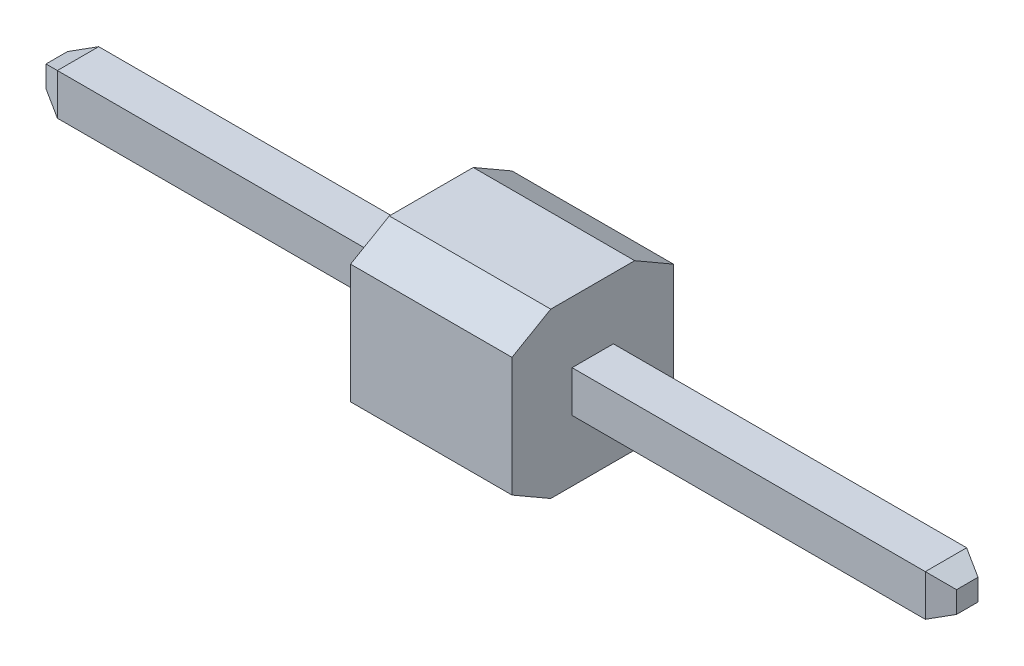
ISO-10303-21;
HEADER;
FILE_DESCRIPTION(('STEP AP214'),'2;1');
FILE_NAME('part.step','',(''),(''),'','','');
FILE_SCHEMA(('AUTOMOTIVE_DESIGN { 1 0 10303 214 1 1 1 1 }'));
ENDSEC;
DATA;
#1=APPLICATION_CONTEXT('core data for automotive mechanical design processes');
#2=APPLICATION_PROTOCOL_DEFINITION('international standard','automotive_design',2000,#1);
#3=PRODUCT_CONTEXT('',#1,'mechanical');
#4=PRODUCT('Part','Part','',(#3));
#5=PRODUCT_RELATED_PRODUCT_CATEGORY('part','',(#4));
#6=PRODUCT_DEFINITION_FORMATION('','',#4);
#7=PRODUCT_DEFINITION_CONTEXT('part definition',#1,'design');
#8=PRODUCT_DEFINITION('design','',#6,#7);
#9=PRODUCT_DEFINITION_SHAPE('','',#8);
#10=(LENGTH_UNIT() NAMED_UNIT(*) SI_UNIT(.MILLI.,.METRE.));
#11=(NAMED_UNIT(*) PLANE_ANGLE_UNIT() SI_UNIT($,.RADIAN.));
#12=(NAMED_UNIT(*) SI_UNIT($,.STERADIAN.) SOLID_ANGLE_UNIT());
#13=UNCERTAINTY_MEASURE_WITH_UNIT(LENGTH_MEASURE(1.E-05),#10,'distance_accuracy_value','');
#14=(GEOMETRIC_REPRESENTATION_CONTEXT(3) GLOBAL_UNCERTAINTY_ASSIGNED_CONTEXT((#13)) GLOBAL_UNIT_ASSIGNED_CONTEXT((#10,
#11,#12)) REPRESENTATION_CONTEXT('',''));
#15=CARTESIAN_POINT('',(0.,0.,0.));
#16=DIRECTION('',(0.,0.,1.));
#17=DIRECTION('',(1.,0.,0.));
#18=AXIS2_PLACEMENT_3D('',#15,#16,#17);
#19=CARTESIAN_POINT('',(5.42104970590608,9.84287173708609,0.629998634255617));
#20=DIRECTION('',(1.,4.37113882867379E-08,-4.37113882867379E-08));
#21=DIRECTION('',(-4.37113882867379E-08,1.,0.));
#22=AXIS2_PLACEMENT_3D('',#19,#20,#21);
#23=PLANE('',#22);
#24=DIRECTION('',(1.59994790123753E-08,0.500000000000192,0.866025403784328));
#25=VECTOR('',#24,1.);
#26=CARTESIAN_POINT('',(5.42104958292016,11.0864615755721,-0.940001365744382));
#27=LINE('',#26,#25);
#28=CARTESIAN_POINT('',(5.42104958292016,11.0864615755721,-0.940001365744382));
#29=VERTEX_POINT('',#28);
#30=CARTESIAN_POINT('',(5.42104959400492,11.4328717370861,-0.340001365744383));
#31=VERTEX_POINT('',#30);
#32=EDGE_CURVE('E11',#29,#31,#27,.T.);
#33=ORIENTED_EDGE('',*,*,#32,.T.);
#34=DIRECTION('',(4.37113886966664E-08,0.,0.999999999999999));
#35=VECTOR('',#34,1.);
#36=CARTESIAN_POINT('',(5.42104959400492,11.4328717370861,-0.340001365744383));
#37=LINE('',#36,#35);
#38=CARTESIAN_POINT('',(5.42104965082973,11.4328717370861,0.959998634255618));
#39=VERTEX_POINT('',#38);
#40=EDGE_CURVE('E304',#31,#39,#37,.T.);
#41=ORIENTED_EDGE('',*,*,#40,.T.);
#42=DIRECTION('',(5.97108656004285E-08,-0.500000000000188,0.866025403784328));
#43=VECTOR('',#42,1.);
#44=CARTESIAN_POINT('',(5.42104965082973,11.4328717370861,0.959998634255618));
#45=LINE('',#44,#43);
#46=CARTESIAN_POINT('',(5.42104969219863,11.0864615755721,1.55999863425562));
#47=VERTEX_POINT('',#46);
#48=EDGE_CURVE('E296',#39,#47,#45,.T.);
#49=ORIENTED_EDGE('',*,*,#48,.T.);
#50=DIRECTION('',(4.37113884815072E-08,-0.999999999999999,0.));
#51=VECTOR('',#50,1.);
#52=CARTESIAN_POINT('',(5.42104969219863,11.0864615755721,1.55999863425562));
#53=LINE('',#52,#51);
#54=CARTESIAN_POINT('',(5.42104977294142,9.23928189860009,1.55999863425562));
#55=VERTEX_POINT('',#54);
#56=EDGE_CURVE('E281',#47,#55,#53,.T.);
#57=ORIENTED_EDGE('',*,*,#56,.T.);
#58=DIRECTION('',(1.59994777304001E-08,0.500000000000192,0.866025403784328));
#59=VECTOR('',#58,1.);
#60=CARTESIAN_POINT('',(5.42104976185665,8.89287173708609,0.959998634255618));
#61=LINE('',#60,#59);
#62=CARTESIAN_POINT('',(5.42104976185665,8.89287173708609,0.959998634255618));
#63=VERTEX_POINT('',#62);
#64=EDGE_CURVE('E265',#63,#55,#61,.T.);
#65=ORIENTED_EDGE('',*,*,#64,.F.);
#66=DIRECTION('',(4.37113886966664E-08,0.,0.999999999999999));
#67=VECTOR('',#66,1.);
#68=CARTESIAN_POINT('',(5.42104970503185,8.89287173708609,-0.340001365744383));
#69=LINE('',#68,#67);
#70=CARTESIAN_POINT('',(5.42104970503185,8.89287173708609,-0.340001365744383));
#71=VERTEX_POINT('',#70);
#72=EDGE_CURVE('E248',#71,#63,#69,.T.);
#73=ORIENTED_EDGE('',*,*,#72,.F.);
#74=DIRECTION('',(5.97108668824036E-08,-0.500000000000188,0.866025403784328));
#75=VECTOR('',#74,1.);
#76=CARTESIAN_POINT('',(5.42104966366295,9.23928189860009,-0.940001365744382));
#77=LINE('',#76,#75);
#78=CARTESIAN_POINT('',(5.42104966366295,9.23928189860009,-0.940001365744382));
#79=VERTEX_POINT('',#78);
#80=EDGE_CURVE('E242',#79,#71,#77,.T.);
#81=ORIENTED_EDGE('',*,*,#80,.F.);
#82=DIRECTION('',(4.37113884815072E-08,-0.999999999999999,0.));
#83=VECTOR('',#82,1.);
#84=CARTESIAN_POINT('',(5.42104958292016,11.0864615755721,-0.940001365744382));
#85=LINE('',#84,#83);
#86=EDGE_CURVE('E236',#29,#79,#85,.T.);
#87=ORIENTED_EDGE('',*,*,#86,.F.);
#88=EDGE_LOOP('',(#33,#41,#49,#57,#65,#73,#81,#87));
#89=FACE_BOUND('',#88,.T.);
#90=DIRECTION('',(-4.37113886753159E-08,0.,-0.999999999999999));
#91=VECTOR('',#90,1.);
#92=CARTESIAN_POINT('',(5.42104967793079,10.4828717370861,0.629998634255617));
#93=LINE('',#92,#91);
#94=CARTESIAN_POINT('',(5.42104967793079,10.4828717370861,0.629998634255617));
#95=VERTEX_POINT('',#94);
#96=CARTESIAN_POINT('',(5.4210496499555,10.4828717370861,-0.0100013657443826));
#97=VERTEX_POINT('',#96);
#98=EDGE_CURVE('E302',#95,#97,#93,.T.);
#99=ORIENTED_EDGE('',*,*,#98,.T.);
#100=DIRECTION('',(-4.3711388675316E-08,0.999999999999999,0.));
#101=VECTOR('',#100,1.);
#102=CARTESIAN_POINT('',(5.42104967793079,9.84287173708609,-0.0100013657443826));
#103=LINE('',#102,#101);
#104=CARTESIAN_POINT('',(5.42104967793079,9.84287173708609,-0.0100013657443826));
#105=VERTEX_POINT('',#104);
#106=EDGE_CURVE('E293',#105,#97,#103,.T.);
#107=ORIENTED_EDGE('',*,*,#106,.F.);
#108=DIRECTION('',(-4.37113886753159E-08,0.,-0.999999999999999));
#109=VECTOR('',#108,1.);
#110=CARTESIAN_POINT('',(5.42104970590608,9.84287173708609,0.629998634255617));
#111=LINE('',#110,#109);
#112=CARTESIAN_POINT('',(5.42104970590608,9.84287173708609,0.629998634255617));
#113=VERTEX_POINT('',#112);
#114=EDGE_CURVE('E278',#113,#105,#111,.T.);
#115=ORIENTED_EDGE('',*,*,#114,.F.);
#116=DIRECTION('',(-4.3711388675316E-08,0.999999999999999,0.));
#117=VECTOR('',#116,1.);
#118=CARTESIAN_POINT('',(5.42104970590608,9.84287173708609,0.629998634255617));
#119=LINE('',#118,#117);
#120=EDGE_CURVE('E263',#113,#95,#119,.T.);
#121=ORIENTED_EDGE('',*,*,#120,.T.);
#122=EDGE_LOOP('',(#99,#107,#115,#121));
#123=FACE_BOUND('',#122,.T.);
#124=ADVANCED_FACE('F17',(#89,#123),#23,.T.);
#125=CARTESIAN_POINT('',(2.92104970590608,9.84287162780762,0.629998743534088));
#126=DIRECTION('',(1.,4.37113882867379E-08,-4.37113882867379E-08));
#127=DIRECTION('',(-4.37113882867379E-08,1.,0.));
#128=AXIS2_PLACEMENT_3D('',#125,#126,#127);
#129=PLANE('',#128);
#130=DIRECTION('',(1.59994783713877E-08,0.500000000000192,0.866025403784328));
#131=VECTOR('',#130,1.);
#132=CARTESIAN_POINT('',(2.92104958292016,11.0864614662936,-0.940001256465912));
#133=LINE('',#132,#131);
#134=CARTESIAN_POINT('',(2.92104958292016,11.0864614662936,-0.940001256465912));
#135=VERTEX_POINT('',#134);
#136=CARTESIAN_POINT('',(2.92104959400492,11.4328716278076,-0.340001256465912));
#137=VERTEX_POINT('',#136);
#138=EDGE_CURVE('E24',#135,#137,#133,.T.);
#139=ORIENTED_EDGE('',*,*,#138,.F.);
#140=DIRECTION('',(4.37113882410924E-08,-0.999999999999999,0.));
#141=VECTOR('',#140,1.);
#142=CARTESIAN_POINT('',(2.92104958292016,11.0864614662936,-0.940001256465912));
#143=LINE('',#142,#141);
#144=CARTESIAN_POINT('',(2.92104966366295,9.23928178932162,-0.940001256465912));
#145=VERTEX_POINT('',#144);
#146=EDGE_CURVE('E300',#135,#145,#143,.T.);
#147=ORIENTED_EDGE('',*,*,#146,.T.);
#148=DIRECTION('',(5.97108668824036E-08,-0.500000000000188,0.866025403784328));
#149=VECTOR('',#148,1.);
#150=CARTESIAN_POINT('',(2.92104966366295,9.23928178932162,-0.940001256465912));
#151=LINE('',#150,#149);
#152=CARTESIAN_POINT('',(2.92104970503185,8.89287162780762,-0.340001256465912));
#153=VERTEX_POINT('',#152);
#154=EDGE_CURVE('E286',#145,#153,#151,.T.);
#155=ORIENTED_EDGE('',*,*,#154,.T.);
#156=DIRECTION('',(4.37113883550593E-08,0.,0.999999999999999));
#157=VECTOR('',#156,1.);
#158=CARTESIAN_POINT('',(2.92104970503185,8.89287162780762,-0.340001256465912));
#159=LINE('',#158,#157);
#160=CARTESIAN_POINT('',(2.92104976185665,8.89287162780762,0.959998743534088));
#161=VERTEX_POINT('',#160);
#162=EDGE_CURVE('E271',#153,#161,#159,.T.);
#163=ORIENTED_EDGE('',*,*,#162,.T.);
#164=DIRECTION('',(1.59994783713877E-08,0.500000000000192,0.866025403784328));
#165=VECTOR('',#164,1.);
#166=CARTESIAN_POINT('',(2.92104976185665,8.89287162780762,0.959998743534088));
#167=LINE('',#166,#165);
#168=CARTESIAN_POINT('',(2.92104977294142,9.23928178932162,1.55999874353409));
#169=VERTEX_POINT('',#168);
#170=EDGE_CURVE('E253',#161,#169,#167,.T.);
#171=ORIENTED_EDGE('',*,*,#170,.T.);
#172=DIRECTION('',(4.37113882410924E-08,-0.999999999999999,0.));
#173=VECTOR('',#172,1.);
#174=CARTESIAN_POINT('',(2.92104969219863,11.0864614662936,1.55999874353409));
#175=LINE('',#174,#173);
#176=CARTESIAN_POINT('',(2.92104969219863,11.0864614662936,1.55999874353409));
#177=VERTEX_POINT('',#176);
#178=EDGE_CURVE('E261',#177,#169,#175,.T.);
#179=ORIENTED_EDGE('',*,*,#178,.F.);
#180=DIRECTION('',(5.97108668824036E-08,-0.500000000000188,0.866025403784328));
#181=VECTOR('',#180,1.);
#182=CARTESIAN_POINT('',(2.92104965082973,11.4328716278076,0.959998743534088));
#183=LINE('',#182,#181);
#184=CARTESIAN_POINT('',(2.92104965082973,11.4328716278076,0.959998743534088));
#185=VERTEX_POINT('',#184);
#186=EDGE_CURVE('E276',#185,#177,#183,.T.);
#187=ORIENTED_EDGE('',*,*,#186,.F.);
#188=DIRECTION('',(4.37113883550593E-08,0.,0.999999999999999));
#189=VECTOR('',#188,1.);
#190=CARTESIAN_POINT('',(2.92104959400492,11.4328716278076,-0.340001256465912));
#191=LINE('',#190,#189);
#192=EDGE_CURVE('E291',#137,#185,#191,.T.);
#193=ORIENTED_EDGE('',*,*,#192,.F.);
#194=EDGE_LOOP('',(#139,#147,#155,#163,#171,#179,#187,#193));
#195=FACE_BOUND('',#194,.T.);
#196=DIRECTION('',(-4.37113879814266E-08,0.999999999999999,0.));
#197=VECTOR('',#196,1.);
#198=CARTESIAN_POINT('',(2.92104967793079,9.84287162780762,-0.0100012564659119));
#199=LINE('',#198,#197);
#200=CARTESIAN_POINT('',(2.92104967793079,9.84287162780762,-0.0100012564659119));
#201=VERTEX_POINT('',#200);
#202=CARTESIAN_POINT('',(2.9210496499555,10.4828716278076,-0.0100012564659119));
#203=VERTEX_POINT('',#202);
#204=EDGE_CURVE('E298',#201,#203,#199,.T.);
#205=ORIENTED_EDGE('',*,*,#204,.T.);
#206=DIRECTION('',(-4.37113879814266E-08,0.,-0.999999999999999));
#207=VECTOR('',#206,1.);
#208=CARTESIAN_POINT('',(2.92104967793079,10.4828716278076,0.629998743534088));
#209=LINE('',#208,#207);
#210=CARTESIAN_POINT('',(2.92104967793079,10.4828716278076,0.629998743534088));
#211=VERTEX_POINT('',#210);
#212=EDGE_CURVE('E283',#211,#203,#209,.T.);
#213=ORIENTED_EDGE('',*,*,#212,.F.);
#214=DIRECTION('',(-4.3711388675316E-08,0.999999999999999,0.));
#215=VECTOR('',#214,1.);
#216=CARTESIAN_POINT('',(2.92104970590608,9.84287162780762,0.629998743534088));
#217=LINE('',#216,#215);
#218=CARTESIAN_POINT('',(2.92104970590608,9.84287162780762,0.629998743534088));
#219=VERTEX_POINT('',#218);
#220=EDGE_CURVE('E268',#219,#211,#217,.T.);
#221=ORIENTED_EDGE('',*,*,#220,.F.);
#222=DIRECTION('',(-4.37113886753159E-08,0.,-0.999999999999999));
#223=VECTOR('',#222,1.);
#224=CARTESIAN_POINT('',(2.92104970590608,9.84287162780762,0.629998743534088));
#225=LINE('',#224,#223);
#226=EDGE_CURVE('E251',#219,#201,#225,.T.);
#227=ORIENTED_EDGE('',*,*,#226,.T.);
#228=EDGE_LOOP('',(#205,#213,#221,#227));
#229=FACE_BOUND('',#228,.T.);
#230=ADVANCED_FACE('F314',(#195,#229),#129,.F.);
#231=CARTESIAN_POINT('',(5.42104958292016,11.0864615755721,-0.940001365744382));
#232=DIRECTION('',(5.97108668343731E-08,-0.866025403784328,0.50000000000019));
#233=DIRECTION('',(-1.59994785476185E-08,-0.500000000000192,-0.866025403784329));
#234=AXIS2_PLACEMENT_3D('',#231,#232,#233);
#235=PLANE('',#234);
#236=ORIENTED_EDGE('',*,*,#138,.T.);
#237=DIRECTION('',(-0.999999999999998,-4.37113889972806E-08,4.37113883755557E-08));
#238=VECTOR('',#237,1.);
#239=CARTESIAN_POINT('',(5.42104959400492,11.4328717370861,-0.340001365744383));
#240=LINE('',#239,#238);
#241=EDGE_CURVE('E288',#31,#137,#240,.T.);
#242=ORIENTED_EDGE('',*,*,#241,.F.);
#243=ORIENTED_EDGE('',*,*,#32,.F.);
#244=DIRECTION('',(-0.999999999999998,-4.37113882867378E-08,4.37113881091022E-08));
#245=VECTOR('',#244,1.);
#246=CARTESIAN_POINT('',(5.42104958292016,11.0864615755721,-0.940001365744382));
#247=LINE('',#246,#245);
#248=EDGE_CURVE('E256',#29,#135,#247,.T.);
#249=ORIENTED_EDGE('',*,*,#248,.T.);
#250=EDGE_LOOP('',(#236,#242,#243,#249));
#251=FACE_BOUND('',#250,.T.);
#252=ADVANCED_FACE('F306',(#251),#235,.F.);
#253=CARTESIAN_POINT('',(5.42104959400492,11.4328717370861,-0.340001365744383));
#254=DIRECTION('',(4.37113882867379E-08,-1.,0.));
#255=DIRECTION('',(1.,4.37113882867379E-08,-4.37113882867379E-08));
#256=AXIS2_PLACEMENT_3D('',#253,#254,#255);
#257=PLANE('',#256);
#258=ORIENTED_EDGE('',*,*,#192,.T.);
#259=DIRECTION('',(-0.999999999999998,-4.37113882867378E-08,4.37113882867378E-08));
#260=VECTOR('',#259,1.);
#261=CARTESIAN_POINT('',(5.42104965082973,11.4328717370861,0.959998634255618));
#262=LINE('',#261,#260);
#263=EDGE_CURVE('E273',#39,#185,#262,.T.);
#264=ORIENTED_EDGE('',*,*,#263,.F.);
#265=ORIENTED_EDGE('',*,*,#40,.F.);
#266=ORIENTED_EDGE('',*,*,#241,.T.);
#267=EDGE_LOOP('',(#258,#264,#265,#266));
#268=FACE_BOUND('',#267,.T.);
#269=ADVANCED_FACE('F311',(#268),#257,.F.);
#270=CARTESIAN_POINT('',(5.42104965082973,11.4328717370861,0.959998634255618));
#271=DIRECTION('',(1.59994785476185E-08,-0.86602540378433,-0.50000000000019));
#272=DIRECTION('',(-5.97108668343731E-08,0.500000000000188,-0.866025403784329));
#273=AXIS2_PLACEMENT_3D('',#270,#271,#272);
#274=PLANE('',#273);
#275=ORIENTED_EDGE('',*,*,#186,.T.);
#276=DIRECTION('',(-0.999999999999998,-4.37113882867378E-08,4.37113882867378E-08));
#277=VECTOR('',#276,1.);
#278=CARTESIAN_POINT('',(5.42104969219863,11.0864615755721,1.55999863425562));
#279=LINE('',#278,#277);
#280=EDGE_CURVE('E258',#47,#177,#279,.T.);
#281=ORIENTED_EDGE('',*,*,#280,.F.);
#282=ORIENTED_EDGE('',*,*,#48,.F.);
#283=ORIENTED_EDGE('',*,*,#263,.T.);
#284=EDGE_LOOP('',(#275,#281,#282,#283));
#285=FACE_BOUND('',#284,.T.);
#286=ADVANCED_FACE('F319',(#285),#274,.F.);
#287=CARTESIAN_POINT('',(5.42104969219863,11.0864615755721,1.55999863425562));
#288=DIRECTION('',(-4.37113882867379E-08,0.,-1.));
#289=DIRECTION('',(-1.,-4.37113882867379E-08,4.37113882867379E-08));
#290=AXIS2_PLACEMENT_3D('',#287,#288,#289);
#291=PLANE('',#290);
#292=ORIENTED_EDGE('',*,*,#178,.T.);
#293=DIRECTION('',(-0.999999999999998,-4.37113889972806E-08,4.37113882867378E-08));
#294=VECTOR('',#293,1.);
#295=CARTESIAN_POINT('',(5.42104977294142,9.23928189860009,1.55999863425562));
#296=LINE('',#295,#294);
#297=EDGE_CURVE('E245',#55,#169,#296,.T.);
#298=ORIENTED_EDGE('',*,*,#297,.F.);
#299=ORIENTED_EDGE('',*,*,#56,.F.);
#300=ORIENTED_EDGE('',*,*,#280,.T.);
#301=EDGE_LOOP('',(#292,#298,#299,#300));
#302=FACE_BOUND('',#301,.T.);
#303=ADVANCED_FACE('F326',(#302),#291,.F.);
#304=CARTESIAN_POINT('',(5.42104976185665,8.89287173708609,0.959998634255618));
#305=DIRECTION('',(5.97108668343731E-08,-0.866025403784328,0.50000000000019));
#306=DIRECTION('',(-1.59994785476185E-08,-0.500000000000192,-0.866025403784329));
#307=AXIS2_PLACEMENT_3D('',#304,#305,#306);
#308=PLANE('',#307);
#309=ORIENTED_EDGE('',*,*,#170,.F.);
#310=DIRECTION('',(-0.999999999999998,-4.37113882867378E-08,4.37113882867378E-08));
#311=VECTOR('',#310,1.);
#312=CARTESIAN_POINT('',(5.42104976185665,8.89287173708609,0.959998634255618));
#313=LINE('',#312,#311);
#314=EDGE_CURVE('E239',#63,#161,#313,.T.);
#315=ORIENTED_EDGE('',*,*,#314,.F.);
#316=ORIENTED_EDGE('',*,*,#64,.T.);
#317=ORIENTED_EDGE('',*,*,#297,.T.);
#318=EDGE_LOOP('',(#309,#315,#316,#317));
#319=FACE_BOUND('',#318,.T.);
#320=ADVANCED_FACE('F329',(#319),#308,.T.);
#321=CARTESIAN_POINT('',(5.42104970503185,8.89287173708609,-0.340001365744383));
#322=DIRECTION('',(4.37113882867379E-08,-1.,0.));
#323=DIRECTION('',(1.,4.37113882867379E-08,-4.37113882867379E-08));
#324=AXIS2_PLACEMENT_3D('',#321,#322,#323);
#325=PLANE('',#324);
#326=ORIENTED_EDGE('',*,*,#162,.F.);
#327=DIRECTION('',(-0.999999999999998,-4.37113882867378E-08,4.37113883755557E-08));
#328=VECTOR('',#327,1.);
#329=CARTESIAN_POINT('',(5.42104970503185,8.89287173708609,-0.340001365744383));
#330=LINE('',#329,#328);
#331=EDGE_CURVE('E233',#71,#153,#330,.T.);
#332=ORIENTED_EDGE('',*,*,#331,.F.);
#333=ORIENTED_EDGE('',*,*,#72,.T.);
#334=ORIENTED_EDGE('',*,*,#314,.T.);
#335=EDGE_LOOP('',(#326,#332,#333,#334));
#336=FACE_BOUND('',#335,.T.);
#337=ADVANCED_FACE('F333',(#336),#325,.T.);
#338=CARTESIAN_POINT('',(5.42104966366295,9.23928189860009,-0.940001365744382));
#339=DIRECTION('',(1.59994785476185E-08,-0.86602540378433,-0.50000000000019));
#340=DIRECTION('',(-5.97108668343731E-08,0.500000000000188,-0.866025403784329));
#341=AXIS2_PLACEMENT_3D('',#338,#339,#340);
#342=PLANE('',#341);
#343=ORIENTED_EDGE('',*,*,#154,.F.);
#344=DIRECTION('',(-0.999999999999998,-4.37113889972806E-08,4.37113881091022E-08));
#345=VECTOR('',#344,1.);
#346=CARTESIAN_POINT('',(5.42104966366295,9.23928189860009,-0.940001365744382));
#347=LINE('',#346,#345);
#348=EDGE_CURVE('E230',#79,#145,#347,.T.);
#349=ORIENTED_EDGE('',*,*,#348,.F.);
#350=ORIENTED_EDGE('',*,*,#80,.T.);
#351=ORIENTED_EDGE('',*,*,#331,.T.);
#352=EDGE_LOOP('',(#343,#349,#350,#351));
#353=FACE_BOUND('',#352,.T.);
#354=ADVANCED_FACE('F337',(#353),#342,.T.);
#355=CARTESIAN_POINT('',(5.42104958292016,11.0864615755721,-0.940001365744382));
#356=DIRECTION('',(-4.37113882867379E-08,0.,-1.));
#357=DIRECTION('',(-4.37113882867379E-08,1.,0.));
#358=AXIS2_PLACEMENT_3D('',#355,#356,#357);
#359=PLANE('',#358);
#360=ORIENTED_EDGE('',*,*,#146,.F.);
#361=ORIENTED_EDGE('',*,*,#248,.F.);
#362=ORIENTED_EDGE('',*,*,#86,.T.);
#363=ORIENTED_EDGE('',*,*,#348,.T.);
#364=EDGE_LOOP('',(#360,#361,#362,#363));
#365=FACE_BOUND('',#364,.T.);
#366=ADVANCED_FACE('F339',(#365),#359,.T.);
#367=CARTESIAN_POINT('',(-2.87895029409392,9.84287137428157,0.62999899706014));
#368=DIRECTION('',(-1.,-4.37113882867379E-08,4.37113882867379E-08));
#369=DIRECTION('',(4.37113882867379E-08,-1.,0.));
#370=AXIS2_PLACEMENT_3D('',#367,#368,#369);
#371=PLANE('',#370);
#372=DIRECTION('',(4.37113874013716E-08,-0.999999999999999,0.));
#373=VECTOR('',#372,1.);
#374=CARTESIAN_POINT('',(-2.87895033659175,10.3289898470906,0.14388052425114));
#375=LINE('',#374,#373);
#376=CARTESIAN_POINT('',(-2.87895033659175,10.3289898470906,0.14388052425114));
#377=VERTEX_POINT('',#376);
#378=CARTESIAN_POINT('',(-2.87895032206921,9.99675290147256,0.14388052425114));
#379=VERTEX_POINT('',#378);
#380=EDGE_CURVE('E228',#377,#379,#375,.T.);
#381=ORIENTED_EDGE('',*,*,#380,.T.);
#382=DIRECTION('',(4.37113900746999E-08,0.,0.999999999999999));
#383=VECTOR('',#382,1.);
#384=CARTESIAN_POINT('',(-2.87895032206921,9.99675290147256,0.14388052425114));
#385=LINE('',#384,#383);
#386=CARTESIAN_POINT('',(-2.87895030754667,9.99675290147256,0.47611746986914));
#387=VERTEX_POINT('',#386);
#388=EDGE_CURVE('E223',#379,#387,#385,.T.);
#389=ORIENTED_EDGE('',*,*,#388,.T.);
#390=DIRECTION('',(-4.37113900746999E-08,0.999999999999999,0.));
#391=VECTOR('',#390,1.);
#392=CARTESIAN_POINT('',(-2.87895030754667,9.99675290147256,0.47611746986914));
#393=LINE('',#392,#391);
#394=CARTESIAN_POINT('',(-2.87895032206921,10.3289898470906,0.47611746986914));
#395=VERTEX_POINT('',#394);
#396=EDGE_CURVE('E215',#387,#395,#393,.T.);
#397=ORIENTED_EDGE('',*,*,#396,.T.);
#398=DIRECTION('',(-4.37113820547151E-08,0.,-0.999999999999999));
#399=VECTOR('',#398,1.);
#400=CARTESIAN_POINT('',(-2.87895032206921,10.3289898470906,0.47611746986914));
#401=LINE('',#400,#399);
#402=EDGE_CURVE('E207',#395,#377,#401,.T.);
#403=ORIENTED_EDGE('',*,*,#402,.T.);
#404=EDGE_LOOP('',(#381,#389,#397,#403));
#405=FACE_BOUND('',#404,.T.);
#406=ADVANCED_FACE('F341',(#405),#371,.T.);
#407=CARTESIAN_POINT('',(-2.87895029409392,9.84287137428157,0.62999899706014));
#408=DIRECTION('',(4.37113882867379E-08,-1.,0.));
#409=DIRECTION('',(-4.37113882867379E-08,0.,-1.));
#410=AXIS2_PLACEMENT_3D('',#407,#408,#409);
#411=PLANE('',#410);
#412=DIRECTION('',(0.999999999999998,4.37113885205545E-08,-4.37113882769955E-08));
#413=VECTOR('',#412,1.);
#414=CARTESIAN_POINT('',(-2.54895029409392,9.84287138870632,0.629998982635382));
#415=LINE('',#414,#413);
#416=CARTESIAN_POINT('',(-2.54895029409392,9.84287138870632,0.629998982635382));
#417=VERTEX_POINT('',#416);
#418=EDGE_CURVE('E225',#417,#219,#415,.T.);
#419=ORIENTED_EDGE('',*,*,#418,.F.);
#420=DIRECTION('',(-4.37113886753159E-08,0.,-0.999999999999999));
#421=VECTOR('',#420,1.);
#422=CARTESIAN_POINT('',(-2.54895029409392,9.84287138870632,0.629998982635382));
#423=LINE('',#422,#421);
#424=CARTESIAN_POINT('',(-2.54895032206921,9.84287138870632,-0.010001017364618));
#425=VERTEX_POINT('',#424);
#426=EDGE_CURVE('E217',#417,#425,#423,.T.);
#427=ORIENTED_EDGE('',*,*,#426,.T.);
#428=DIRECTION('',(0.999999999999998,4.37113885205545E-08,-4.37113882161057E-08));
#429=VECTOR('',#428,1.);
#430=CARTESIAN_POINT('',(-2.54895032206921,9.84287138870632,-0.010001017364618));
#431=LINE('',#430,#429);
#432=EDGE_CURVE('E220',#425,#201,#431,.T.);
#433=ORIENTED_EDGE('',*,*,#432,.T.);
#434=ORIENTED_EDGE('',*,*,#226,.F.);
#435=EDGE_LOOP('',(#419,#427,#433,#434));
#436=FACE_BOUND('',#435,.T.);
#437=ADVANCED_FACE('F348',(#436),#411,.T.);
#438=CARTESIAN_POINT('',(-2.87895032206921,9.84287137428157,-0.0100010029398598));
#439=DIRECTION('',(-4.37113882867379E-08,0.,-1.));
#440=DIRECTION('',(-1.,-4.37113882867379E-08,4.37113882867379E-08));
#441=AXIS2_PLACEMENT_3D('',#438,#439,#440);
#442=PLANE('',#441);
#443=ORIENTED_EDGE('',*,*,#432,.F.);
#444=DIRECTION('',(-4.37113886753159E-08,0.999999999999999,0.));
#445=VECTOR('',#444,1.);
#446=CARTESIAN_POINT('',(-2.54895032206921,9.84287138870632,-0.010001017364618));
#447=LINE('',#446,#445);
#448=CARTESIAN_POINT('',(-2.5489503500445,10.4828713887063,-0.010001017364618));
#449=VERTEX_POINT('',#448);
#450=EDGE_CURVE('E209',#425,#449,#447,.T.);
#451=ORIENTED_EDGE('',*,*,#450,.T.);
#452=DIRECTION('',(0.999999999999998,4.37113881958092E-08,-4.37113882161057E-08));
#453=VECTOR('',#452,1.);
#454=CARTESIAN_POINT('',(-2.5489503500445,10.4828713887063,-0.010001017364618));
#455=LINE('',#454,#453);
#456=EDGE_CURVE('E212',#449,#203,#455,.T.);
#457=ORIENTED_EDGE('',*,*,#456,.T.);
#458=ORIENTED_EDGE('',*,*,#204,.F.);
#459=EDGE_LOOP('',(#443,#451,#457,#458));
#460=FACE_BOUND('',#459,.T.);
#461=ADVANCED_FACE('F424',(#460),#442,.T.);
#462=CARTESIAN_POINT('',(-2.87895032206921,10.4828713742816,0.62999899706014));
#463=DIRECTION('',(4.37113882867379E-08,-1.,0.));
#464=DIRECTION('',(-4.37113882867379E-08,0.,-1.));
#465=AXIS2_PLACEMENT_3D('',#462,#463,#464);
#466=PLANE('',#465);
#467=ORIENTED_EDGE('',*,*,#456,.F.);
#468=DIRECTION('',(4.37113900630947E-08,0.,0.999999999999999));
#469=VECTOR('',#468,1.);
#470=CARTESIAN_POINT('',(-2.5489503500445,10.4828713887063,-0.010001017364618));
#471=LINE('',#470,#469);
#472=CARTESIAN_POINT('',(-2.54895032206921,10.4828713887063,0.629998982635382));
#473=VERTEX_POINT('',#472);
#474=EDGE_CURVE('E201',#449,#473,#471,.T.);
#475=ORIENTED_EDGE('',*,*,#474,.T.);
#476=DIRECTION('',(0.999999999999998,4.37113881958092E-08,-4.37113882769955E-08));
#477=VECTOR('',#476,1.);
#478=CARTESIAN_POINT('',(-2.54895032206921,10.4828713887063,0.629998982635382));
#479=LINE('',#478,#477);
#480=EDGE_CURVE('E204',#473,#211,#479,.T.);
#481=ORIENTED_EDGE('',*,*,#480,.T.);
#482=ORIENTED_EDGE('',*,*,#212,.T.);
#483=EDGE_LOOP('',(#467,#475,#481,#482));
#484=FACE_BOUND('',#483,.T.);
#485=ADVANCED_FACE('F421',(#484),#466,.F.);
#486=CARTESIAN_POINT('',(-2.87895029409392,9.84287137428157,0.62999899706014));
#487=DIRECTION('',(-4.37113882867379E-08,0.,-1.));
#488=DIRECTION('',(-1.,-4.37113882867379E-08,4.37113882867379E-08));
#489=AXIS2_PLACEMENT_3D('',#486,#487,#488);
#490=PLANE('',#489);
#491=ORIENTED_EDGE('',*,*,#480,.F.);
#492=DIRECTION('',(4.37113900630947E-08,-0.999999999999999,0.));
#493=VECTOR('',#492,1.);
#494=CARTESIAN_POINT('',(-2.54895032206921,10.4828713887063,0.629998982635382));
#495=LINE('',#494,#493);
#496=EDGE_CURVE('E196',#473,#417,#495,.T.);
#497=ORIENTED_EDGE('',*,*,#496,.T.);
#498=ORIENTED_EDGE('',*,*,#418,.T.);
#499=ORIENTED_EDGE('',*,*,#220,.T.);
#500=EDGE_LOOP('',(#491,#497,#498,#499));
#501=FACE_BOUND('',#500,.T.);
#502=ADVANCED_FACE('F376',(#501),#490,.F.);
#503=CARTESIAN_POINT('',(-2.87895029409392,9.84287137428157,0.62999899706014));
#504=DIRECTION('',(-4.37113882867379E-08,0.,-1.));
#505=DIRECTION('',(-1.,-4.37113882867379E-08,4.37113882867379E-08));
#506=AXIS2_PLACEMENT_3D('',#503,#504,#505);
#507=PLANE('',#506);
#508=DIRECTION('',(0.999999999999998,4.37113881958092E-08,-4.37113882769955E-08));
#509=VECTOR('',#508,1.);
#510=CARTESIAN_POINT('',(5.42104970590608,9.84287173708609,0.629998634255617));
#511=LINE('',#510,#509);
#512=CARTESIAN_POINT('',(10.8910497059061,9.84287197618738,0.629998395154324));
#513=VERTEX_POINT('',#512);
#514=EDGE_CURVE('E199',#113,#513,#511,.T.);
#515=ORIENTED_EDGE('',*,*,#514,.T.);
#516=DIRECTION('',(-4.37113900630947E-08,0.999999999999999,0.));
#517=VECTOR('',#516,1.);
#518=CARTESIAN_POINT('',(10.8910497059061,9.84287197618738,0.629998395154324));
#519=LINE('',#518,#517);
#520=CARTESIAN_POINT('',(10.8910496779308,10.4828719761874,0.629998395154324));
#521=VERTEX_POINT('',#520);
#522=EDGE_CURVE('E191',#513,#521,#519,.T.);
#523=ORIENTED_EDGE('',*,*,#522,.T.);
#524=DIRECTION('',(0.999999999999998,4.37113885205545E-08,-4.37113882769955E-08));
#525=VECTOR('',#524,1.);
#526=CARTESIAN_POINT('',(5.42104967793079,10.4828717370861,0.629998634255617));
#527=LINE('',#526,#525);
#528=EDGE_CURVE('E194',#95,#521,#527,.T.);
#529=ORIENTED_EDGE('',*,*,#528,.F.);
#530=ORIENTED_EDGE('',*,*,#120,.F.);
#531=EDGE_LOOP('',(#515,#523,#529,#530));
#532=FACE_BOUND('',#531,.T.);
#533=ADVANCED_FACE('F367',(#532),#507,.F.);
#534=CARTESIAN_POINT('',(-2.87895032206921,10.4828713742816,0.62999899706014));
#535=DIRECTION('',(4.37113882867379E-08,-1.,0.));
#536=DIRECTION('',(-4.37113882867379E-08,0.,-1.));
#537=AXIS2_PLACEMENT_3D('',#534,#535,#536);
#538=PLANE('',#537);
#539=ORIENTED_EDGE('',*,*,#528,.T.);
#540=DIRECTION('',(-4.37113900630947E-08,0.,-0.999999999999999));
#541=VECTOR('',#540,1.);
#542=CARTESIAN_POINT('',(10.8910496779308,10.4828719761874,0.629998395154324));
#543=LINE('',#542,#541);
#544=CARTESIAN_POINT('',(10.8910496499555,10.4828719761874,-0.0100016048456765));
#545=VERTEX_POINT('',#544);
#546=EDGE_CURVE('E186',#521,#545,#543,.T.);
#547=ORIENTED_EDGE('',*,*,#546,.T.);
#548=DIRECTION('',(0.999999999999998,4.37113888452998E-08,-4.37113881146228E-08));
#549=VECTOR('',#548,1.);
#550=CARTESIAN_POINT('',(5.4210496499555,10.4828717370861,-0.0100013657443823));
#551=LINE('',#550,#549);
#552=EDGE_CURVE('E189',#97,#545,#551,.T.);
#553=ORIENTED_EDGE('',*,*,#552,.F.);
#554=ORIENTED_EDGE('',*,*,#98,.F.);
#555=EDGE_LOOP('',(#539,#547,#553,#554));
#556=FACE_BOUND('',#555,.T.);
#557=ADVANCED_FACE('F364',(#556),#538,.F.);
#558=CARTESIAN_POINT('',(-2.87895032206921,9.84287137428157,-0.0100010029398598));
#559=DIRECTION('',(-4.37113882867379E-08,0.,-1.));
#560=DIRECTION('',(-1.,-4.37113882867379E-08,4.37113882867379E-08));
#561=AXIS2_PLACEMENT_3D('',#558,#559,#560);
#562=PLANE('',#561);
#563=ORIENTED_EDGE('',*,*,#552,.T.);
#564=DIRECTION('',(4.37113900630947E-08,-0.999999999999999,0.));
#565=VECTOR('',#564,1.);
#566=CARTESIAN_POINT('',(10.8910496499555,10.4828719761874,-0.0100016048456765));
#567=LINE('',#566,#565);
#568=CARTESIAN_POINT('',(10.8910496779308,9.84287197618738,-0.0100016048456765));
#569=VERTEX_POINT('',#568);
#570=EDGE_CURVE('E176',#545,#569,#567,.T.);
#571=ORIENTED_EDGE('',*,*,#570,.T.);
#572=DIRECTION('',(0.999999999999998,4.37113885205545E-08,-4.37113881146228E-08));
#573=VECTOR('',#572,1.);
#574=CARTESIAN_POINT('',(5.42104967793079,9.84287173708609,-0.0100013657443823));
#575=LINE('',#574,#573);
#576=EDGE_CURVE('E179',#105,#569,#575,.T.);
#577=ORIENTED_EDGE('',*,*,#576,.F.);
#578=ORIENTED_EDGE('',*,*,#106,.T.);
#579=EDGE_LOOP('',(#563,#571,#577,#578));
#580=FACE_BOUND('',#579,.T.);
#581=ADVANCED_FACE('F366',(#580),#562,.T.);
#582=CARTESIAN_POINT('',(-2.87895029409392,9.84287137428157,0.62999899706014));
#583=DIRECTION('',(4.37113882867379E-08,-1.,0.));
#584=DIRECTION('',(-4.37113882867379E-08,0.,-1.));
#585=AXIS2_PLACEMENT_3D('',#582,#583,#584);
#586=PLANE('',#585);
#587=ORIENTED_EDGE('',*,*,#576,.T.);
#588=DIRECTION('',(4.37113900630947E-08,0.,0.999999999999999));
#589=VECTOR('',#588,1.);
#590=CARTESIAN_POINT('',(10.8910496779308,9.84287197618738,-0.0100016048456765));
#591=LINE('',#590,#589);
#592=EDGE_CURVE('E167',#569,#513,#591,.T.);
#593=ORIENTED_EDGE('',*,*,#592,.T.);
#594=ORIENTED_EDGE('',*,*,#514,.F.);
#595=ORIENTED_EDGE('',*,*,#114,.T.);
#596=EDGE_LOOP('',(#587,#593,#594,#595));
#597=FACE_BOUND('',#596,.T.);
#598=ADVANCED_FACE('F373',(#597),#586,.T.);
#599=CARTESIAN_POINT('',(11.2210497059061,9.84287199061214,0.629998380729565));
#600=DIRECTION('',(-1.,-4.37113882867379E-08,4.37113882867379E-08));
#601=DIRECTION('',(4.37113882867379E-08,-1.,0.));
#602=AXIS2_PLACEMENT_3D('',#599,#600,#601);
#603=PLANE('',#602);
#604=DIRECTION('',(-4.37113927480282E-08,0.999999999999999,0.));
#605=VECTOR('',#604,1.);
#606=CARTESIAN_POINT('',(11.2210496779308,9.99675351780314,0.143879907920565));
#607=LINE('',#606,#605);
#608=CARTESIAN_POINT('',(11.2210496779308,9.99675351780314,0.143879907920565));
#609=VERTEX_POINT('',#608);
#610=CARTESIAN_POINT('',(11.2210496634083,10.3289904634211,0.143879907920565));
#611=VERTEX_POINT('',#610);
#612=EDGE_CURVE('E153',#609,#611,#607,.T.);
#613=ORIENTED_EDGE('',*,*,#612,.T.);
#614=DIRECTION('',(4.37113927480282E-08,0.,0.999999999999999));
#615=VECTOR('',#614,1.);
#616=CARTESIAN_POINT('',(11.2210496634083,10.3289904634211,0.143879907920565));
#617=LINE('',#616,#615);
#618=CARTESIAN_POINT('',(11.2210496779308,10.3289904634211,0.476116853538565));
#619=VERTEX_POINT('',#618);
#620=EDGE_CURVE('E395',#611,#619,#617,.T.);
#621=ORIENTED_EDGE('',*,*,#620,.T.);
#622=DIRECTION('',(4.37113874013716E-08,-0.999999999999999,0.));
#623=VECTOR('',#622,1.);
#624=CARTESIAN_POINT('',(11.2210496779308,10.3289904634211,0.476116853538565));
#625=LINE('',#624,#623);
#626=CARTESIAN_POINT('',(11.2210496924533,9.99675351780314,0.476116853538565));
#627=VERTEX_POINT('',#626);
#628=EDGE_CURVE('E156',#619,#627,#625,.T.);
#629=ORIENTED_EDGE('',*,*,#628,.T.);
#630=DIRECTION('',(-4.37113927480282E-08,0.,-0.999999999999999));
#631=VECTOR('',#630,1.);
#632=CARTESIAN_POINT('',(11.2210496924533,9.99675351780314,0.476116853538565));
#633=LINE('',#632,#631);
#634=EDGE_CURVE('E149',#627,#609,#633,.T.);
#635=ORIENTED_EDGE('',*,*,#634,.T.);
#636=EDGE_LOOP('',(#613,#621,#629,#635));
#637=FACE_BOUND('',#636,.T.);
#638=ADVANCED_FACE('F151',(#637),#603,.F.);
#639=CARTESIAN_POINT('',(-2.87895031534284,10.3289898470906,0.62999899706014));
#640=DIRECTION('',(-0.422618301356784,0.906307768563367,1.84732310895534E-08));
#641=DIRECTION('',(4.37113882867379E-08,0.,1.));
#642=AXIS2_PLACEMENT_3D('',#639,#640,#641);
#643=PLANE('',#642);
#644=DIRECTION('',(0.834817095446927,0.389281657126016,-0.389281657126019));
#645=VECTOR('',#644,1.);
#646=CARTESIAN_POINT('',(-2.87895033659144,10.3289898470902,0.143880524251471));
#647=LINE('',#646,#645);
#648=EDGE_CURVE('E181',#377,#449,#647,.T.);
#649=ORIENTED_EDGE('',*,*,#648,.F.);
#650=ORIENTED_EDGE('',*,*,#402,.F.);
#651=DIRECTION('',(-0.834817129479006,-0.38928165712602,-0.389281584143987));
#652=VECTOR('',#651,1.);
#653=CARTESIAN_POINT('',(-2.54895032206899,10.4828713887061,0.629998982635147));
#654=LINE('',#653,#652);
#655=EDGE_CURVE('E404',#473,#395,#654,.T.);
#656=ORIENTED_EDGE('',*,*,#655,.F.);
#657=ORIENTED_EDGE('',*,*,#474,.F.);
#658=EDGE_LOOP('',(#649,#650,#656,#657));
#659=FACE_BOUND('',#658,.T.);
#660=ADVANCED_FACE('F418',(#659),#643,.T.);
#661=CARTESIAN_POINT('',(-2.8789503008203,9.84287137428157,0.47611746986914));
#662=DIRECTION('',(-0.422618222124841,-1.84732292043498E-08,0.906307805509828));
#663=DIRECTION('',(4.37113882867379E-08,-1.,0.));
#664=AXIS2_PLACEMENT_3D('',#661,#662,#663);
#665=PLANE('',#664);
#666=ORIENTED_EDGE('',*,*,#655,.T.);
#667=ORIENTED_EDGE('',*,*,#396,.F.);
#668=DIRECTION('',(-0.834817163511086,0.389281584143988,-0.389281584143987));
#669=VECTOR('',#668,1.);
#670=CARTESIAN_POINT('',(-2.54895029409375,9.84287138870651,0.629998982635199));
#671=LINE('',#670,#669);
#672=EDGE_CURVE('E160',#417,#387,#671,.T.);
#673=ORIENTED_EDGE('',*,*,#672,.F.);
#674=ORIENTED_EDGE('',*,*,#496,.F.);
#675=EDGE_LOOP('',(#666,#667,#673,#674));
#676=FACE_BOUND('',#675,.T.);
#677=ADVANCED_FACE('F434',(#676),#665,.T.);
#678=CARTESIAN_POINT('',(-2.54895032206921,9.84287138870632,-0.010001017364618));
#679=DIRECTION('',(0.422618301356784,1.8473232667688E-08,0.906307768563367));
#680=DIRECTION('',(-4.37113882867379E-08,1.,0.));
#681=AXIS2_PLACEMENT_3D('',#678,#679,#680);
#682=PLANE('',#681);
#683=ORIENTED_EDGE('',*,*,#648,.T.);
#684=ORIENTED_EDGE('',*,*,#450,.F.);
#685=DIRECTION('',(0.834817129479005,-0.389281584143991,-0.389281657126017));
#686=VECTOR('',#685,1.);
#687=CARTESIAN_POINT('',(-2.87895032206912,9.99675290147266,0.143880524251236));
#688=LINE('',#687,#686);
#689=EDGE_CURVE('E170',#379,#425,#688,.T.);
#690=ORIENTED_EDGE('',*,*,#689,.F.);
#691=ORIENTED_EDGE('',*,*,#380,.F.);
#692=EDGE_LOOP('',(#683,#684,#690,#691));
#693=FACE_BOUND('',#692,.T.);
#694=ADVANCED_FACE('F413',(#693),#682,.F.);
#695=CARTESIAN_POINT('',(-2.54895029409392,9.84287138870632,0.629998982635382));
#696=DIRECTION('',(0.422618222124841,0.906307805509828,-1.84732308250282E-08));
#697=DIRECTION('',(-4.37113882867379E-08,0.,-1.));
#698=AXIS2_PLACEMENT_3D('',#695,#696,#697);
#699=PLANE('',#698);
#700=ORIENTED_EDGE('',*,*,#672,.T.);
#701=ORIENTED_EDGE('',*,*,#388,.F.);
#702=ORIENTED_EDGE('',*,*,#689,.T.);
#703=ORIENTED_EDGE('',*,*,#426,.F.);
#704=EDGE_LOOP('',(#700,#701,#702,#703));
#705=FACE_BOUND('',#704,.T.);
#706=ADVANCED_FACE('F429',(#705),#699,.F.);
#707=CARTESIAN_POINT('',(11.2210496991797,9.99675351780314,0.629998380729565));
#708=DIRECTION('',(0.422618301356784,-0.906307768563367,-1.84732310470096E-08));
#709=DIRECTION('',(4.37113882867379E-08,0.,1.));
#710=AXIS2_PLACEMENT_3D('',#707,#708,#709);
#711=PLANE('',#710);
#712=DIRECTION('',(-0.834817129479009,-0.389281657126014,-0.389281584143986));
#713=VECTOR('',#712,1.);
#714=CARTESIAN_POINT('',(11.2210496779305,9.99675351780347,0.143879907920896));
#715=LINE('',#714,#713);
#716=EDGE_CURVE('E164',#609,#569,#715,.T.);
#717=ORIENTED_EDGE('',*,*,#716,.F.);
#718=ORIENTED_EDGE('',*,*,#634,.F.);
#719=DIRECTION('',(0.834817095446927,0.389281657126015,-0.389281657126019));
#720=VECTOR('',#719,1.);
#721=CARTESIAN_POINT('',(10.8910497059061,9.84287197618738,0.629998395154324));
#722=LINE('',#721,#720);
#723=EDGE_CURVE('E392',#513,#627,#722,.T.);
#724=ORIENTED_EDGE('',*,*,#723,.F.);
#725=ORIENTED_EDGE('',*,*,#592,.F.);
#726=EDGE_LOOP('',(#717,#718,#724,#725));
#727=FACE_BOUND('',#726,.T.);
#728=ADVANCED_FACE('F165',(#727),#711,.T.);
#729=CARTESIAN_POINT('',(10.8910497059061,9.84287197618738,0.629998395154324));
#730=DIRECTION('',(-0.422618301356784,-1.8473232667688E-08,-0.906307768563367));
#731=DIRECTION('',(-4.37113882867379E-08,1.,0.));
#732=AXIS2_PLACEMENT_3D('',#729,#730,#731);
#733=PLANE('',#732);
#734=ORIENTED_EDGE('',*,*,#723,.T.);
#735=ORIENTED_EDGE('',*,*,#628,.F.);
#736=DIRECTION('',(0.834817129479006,-0.389281584143988,-0.389281657126019));
#737=VECTOR('',#736,1.);
#738=CARTESIAN_POINT('',(10.8910496779307,10.4828719761873,0.629998395154179));
#739=LINE('',#738,#737);
#740=EDGE_CURVE('E389',#521,#619,#739,.T.);
#741=ORIENTED_EDGE('',*,*,#740,.F.);
#742=ORIENTED_EDGE('',*,*,#522,.F.);
#743=EDGE_LOOP('',(#734,#735,#741,#742));
#744=FACE_BOUND('',#743,.T.);
#745=ADVANCED_FACE('F390',(#744),#733,.F.);
#746=CARTESIAN_POINT('',(11.2210496846572,9.84287199061214,0.143879907920565));
#747=DIRECTION('',(0.422618222124841,1.84732292043498E-08,-0.906307805509828));
#748=DIRECTION('',(4.37113882867379E-08,-1.,0.));
#749=AXIS2_PLACEMENT_3D('',#746,#747,#748);
#750=PLANE('',#749);
#751=ORIENTED_EDGE('',*,*,#716,.T.);
#752=ORIENTED_EDGE('',*,*,#570,.F.);
#753=DIRECTION('',(-0.834817163511087,0.389281584143984,-0.389281584143988));
#754=VECTOR('',#753,1.);
#755=CARTESIAN_POINT('',(11.2210496634079,10.3289904634208,0.143879907920896));
#756=LINE('',#755,#754);
#757=EDGE_CURVE('E175',#611,#545,#756,.T.);
#758=ORIENTED_EDGE('',*,*,#757,.F.);
#759=ORIENTED_EDGE('',*,*,#612,.F.);
#760=EDGE_LOOP('',(#751,#752,#758,#759));
#761=FACE_BOUND('',#760,.T.);
#762=ADVANCED_FACE('F173',(#761),#750,.T.);
#763=CARTESIAN_POINT('',(10.8910496779308,10.4828719761874,0.629998395154324));
#764=DIRECTION('',(-0.422618222124841,-0.906307805509828,1.84732307824844E-08));
#765=DIRECTION('',(-4.37113882867379E-08,0.,-1.));
#766=AXIS2_PLACEMENT_3D('',#763,#764,#765);
#767=PLANE('',#766);
#768=ORIENTED_EDGE('',*,*,#740,.T.);
#769=ORIENTED_EDGE('',*,*,#620,.F.);
#770=ORIENTED_EDGE('',*,*,#757,.T.);
#771=ORIENTED_EDGE('',*,*,#546,.F.);
#772=EDGE_LOOP('',(#768,#769,#770,#771));
#773=FACE_BOUND('',#772,.T.);
#774=ADVANCED_FACE('F394',(#773),#767,.F.);
#775=CLOSED_SHELL('',(#124,#230,#252,#269,#286,#303,#320,#337,#354,#366,#406,#437,#461,#485,
#502,#533,#557,#581,#598,#638,#660,#677,#694,#706,#728,#745,#762,#774));
#776=MANIFOLD_SOLID_BREP('B1',#775);
#777=ADVANCED_BREP_SHAPE_REPRESENTATION('',(#18,#776),#14);
#778=SHAPE_DEFINITION_REPRESENTATION(#9,#777);
ENDSEC;
END-ISO-10303-21;
